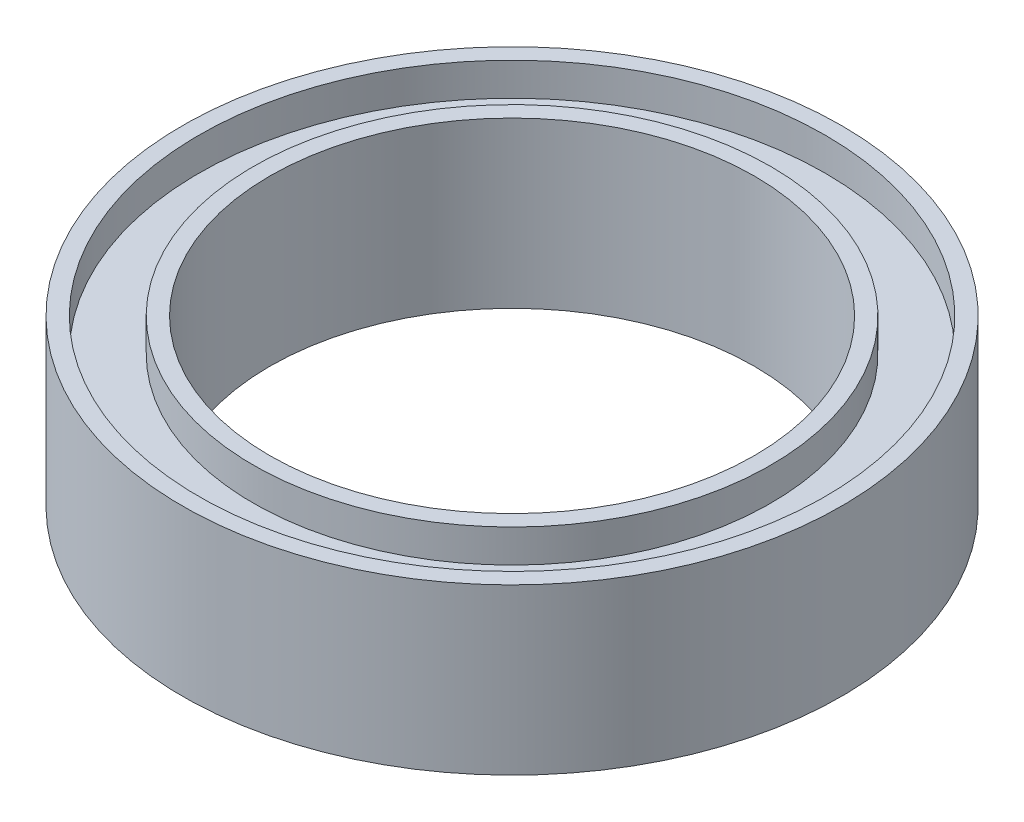
ISO-10303-21;
HEADER;
FILE_DESCRIPTION(('STEP AP214'),'2;1');
FILE_NAME('part.step','',(''),(''),'','','');
FILE_SCHEMA(('AUTOMOTIVE_DESIGN { 1 0 10303 214 1 1 1 1 }'));
ENDSEC;
DATA;
#1=APPLICATION_CONTEXT('core data for automotive mechanical design processes');
#2=APPLICATION_PROTOCOL_DEFINITION('international standard','automotive_design',2000,#1);
#3=PRODUCT_CONTEXT('',#1,'mechanical');
#4=PRODUCT('Part','Part','',(#3));
#5=PRODUCT_RELATED_PRODUCT_CATEGORY('part','',(#4));
#6=PRODUCT_DEFINITION_FORMATION('','',#4);
#7=PRODUCT_DEFINITION_CONTEXT('part definition',#1,'design');
#8=PRODUCT_DEFINITION('design','',#6,#7);
#9=PRODUCT_DEFINITION_SHAPE('','',#8);
#10=(LENGTH_UNIT() NAMED_UNIT(*) SI_UNIT(.MILLI.,.METRE.));
#11=(NAMED_UNIT(*) PLANE_ANGLE_UNIT() SI_UNIT($,.RADIAN.));
#12=(NAMED_UNIT(*) SI_UNIT($,.STERADIAN.) SOLID_ANGLE_UNIT());
#13=UNCERTAINTY_MEASURE_WITH_UNIT(LENGTH_MEASURE(1.E-05),#10,'distance_accuracy_value','');
#14=(GEOMETRIC_REPRESENTATION_CONTEXT(3) GLOBAL_UNCERTAINTY_ASSIGNED_CONTEXT((#13)) GLOBAL_UNIT_ASSIGNED_CONTEXT((#10,
#11,#12)) REPRESENTATION_CONTEXT('',''));
#15=CARTESIAN_POINT('',(0.,0.,0.));
#16=DIRECTION('',(0.,0.,1.));
#17=DIRECTION('',(1.,0.,0.));
#18=AXIS2_PLACEMENT_3D('',#15,#16,#17);
#19=CARTESIAN_POINT('',(0.,50.,0.));
#20=DIRECTION('',(0.,-1.,0.));
#21=DIRECTION('',(0.,0.,-1.));
#22=AXIS2_PLACEMENT_3D('',#19,#20,#21);
#23=PLANE('',#22);
#24=CARTESIAN_POINT('',(-73.5,50.,0.));
#25=DIRECTION('',(0.,-1.,0.));
#26=DIRECTION('',(0.,0.,-1.));
#27=AXIS2_PLACEMENT_3D('',#24,#25,#26);
#28=CIRCLE('',#27,100.);
#29=CARTESIAN_POINT('',(-73.5,50.,-100.));
#30=VERTEX_POINT('',#29);
#31=EDGE_CURVE('E79',#30,#30,#28,.T.);
#32=ORIENTED_EDGE('',*,*,#31,.F.);
#33=EDGE_LOOP('',(#32));
#34=FACE_BOUND('',#33,.T.);
#35=CARTESIAN_POINT('',(-73.5,50.,0.));
#36=DIRECTION('',(0.,-1.,0.));
#37=DIRECTION('',(0.,0.,-1.));
#38=AXIS2_PLACEMENT_3D('',#35,#36,#37);
#39=CIRCLE('',#38,95.);
#40=CARTESIAN_POINT('',(-73.5,50.,-95.));
#41=VERTEX_POINT('',#40);
#42=EDGE_CURVE('E10',#41,#41,#39,.T.);
#43=ORIENTED_EDGE('',*,*,#42,.T.);
#44=EDGE_LOOP('',(#43));
#45=FACE_BOUND('',#44,.T.);
#46=ADVANCED_FACE('F39',(#34,#45),#23,.F.);
#47=CARTESIAN_POINT('',(-73.5,0.,0.));
#48=DIRECTION('',(0.,-1.,0.));
#49=DIRECTION('',(0.,0.,-1.));
#50=AXIS2_PLACEMENT_3D('',#47,#48,#49);
#51=CYLINDRICAL_SURFACE('',#50,95.);
#52=ORIENTED_EDGE('',*,*,#42,.F.);
#53=EDGE_LOOP('',(#52));
#54=FACE_BOUND('',#53,.T.);
#55=CARTESIAN_POINT('',(-73.5,40.,0.));
#56=DIRECTION('',(0.,-1.,0.));
#57=DIRECTION('',(0.,0.,-1.));
#58=AXIS2_PLACEMENT_3D('',#55,#56,#57);
#59=CIRCLE('',#58,95.);
#60=CARTESIAN_POINT('',(-73.5,40.,-95.));
#61=VERTEX_POINT('',#60);
#62=EDGE_CURVE('E45',#61,#61,#59,.T.);
#63=ORIENTED_EDGE('',*,*,#62,.T.);
#64=EDGE_LOOP('',(#63));
#65=FACE_BOUND('',#64,.T.);
#66=ADVANCED_FACE('F86',(#54,#65),#51,.F.);
#67=CARTESIAN_POINT('',(0.,40.,0.));
#68=DIRECTION('',(0.,-1.,0.));
#69=DIRECTION('',(0.,0.,-1.));
#70=AXIS2_PLACEMENT_3D('',#67,#68,#69);
#71=PLANE('',#70);
#72=ORIENTED_EDGE('',*,*,#62,.F.);
#73=EDGE_LOOP('',(#72));
#74=FACE_BOUND('',#73,.T.);
#75=CARTESIAN_POINT('',(-73.5,40.,0.));
#76=DIRECTION('',(0.,-1.,0.));
#77=DIRECTION('',(0.,0.,-1.));
#78=AXIS2_PLACEMENT_3D('',#75,#76,#77);
#79=CIRCLE('',#78,78.5);
#80=CARTESIAN_POINT('',(-73.5,40.,-78.5));
#81=VERTEX_POINT('',#80);
#82=EDGE_CURVE('E49',#81,#81,#79,.T.);
#83=ORIENTED_EDGE('',*,*,#82,.T.);
#84=EDGE_LOOP('',(#83));
#85=FACE_BOUND('',#84,.T.);
#86=ADVANCED_FACE('F90',(#74,#85),#71,.F.);
#87=CARTESIAN_POINT('',(-73.5,0.,0.));
#88=DIRECTION('',(0.,-1.,0.));
#89=DIRECTION('',(0.,0.,-1.));
#90=AXIS2_PLACEMENT_3D('',#87,#88,#89);
#91=CYLINDRICAL_SURFACE('',#90,78.5);
#92=ORIENTED_EDGE('',*,*,#82,.F.);
#93=EDGE_LOOP('',(#92));
#94=FACE_BOUND('',#93,.T.);
#95=CARTESIAN_POINT('',(-73.5,50.,0.));
#96=DIRECTION('',(0.,-1.,0.));
#97=DIRECTION('',(0.,0.,-1.));
#98=AXIS2_PLACEMENT_3D('',#95,#96,#97);
#99=CIRCLE('',#98,78.5);
#100=CARTESIAN_POINT('',(-73.5,50.,-78.5));
#101=VERTEX_POINT('',#100);
#102=EDGE_CURVE('E53',#101,#101,#99,.T.);
#103=ORIENTED_EDGE('',*,*,#102,.T.);
#104=EDGE_LOOP('',(#103));
#105=FACE_BOUND('',#104,.T.);
#106=ADVANCED_FACE('F95',(#94,#105),#91,.T.);
#107=CARTESIAN_POINT('',(0.,50.,0.));
#108=DIRECTION('',(0.,-1.,0.));
#109=DIRECTION('',(0.,0.,-1.));
#110=AXIS2_PLACEMENT_3D('',#107,#108,#109);
#111=PLANE('',#110);
#112=ORIENTED_EDGE('',*,*,#102,.F.);
#113=EDGE_LOOP('',(#112));
#114=FACE_BOUND('',#113,.T.);
#115=CARTESIAN_POINT('',(-73.5,50.,0.));
#116=DIRECTION('',(0.,-1.,0.));
#117=DIRECTION('',(0.,0.,-1.));
#118=AXIS2_PLACEMENT_3D('',#115,#116,#117);
#119=CIRCLE('',#118,73.5);
#120=CARTESIAN_POINT('',(-73.5,50.,-73.5));
#121=VERTEX_POINT('',#120);
#122=EDGE_CURVE('E58',#121,#121,#119,.T.);
#123=ORIENTED_EDGE('',*,*,#122,.T.);
#124=EDGE_LOOP('',(#123));
#125=FACE_BOUND('',#124,.T.);
#126=ADVANCED_FACE('F101',(#114,#125),#111,.F.);
#127=CARTESIAN_POINT('',(-73.5,0.,0.));
#128=DIRECTION('',(0.,-1.,0.));
#129=DIRECTION('',(0.,0.,-1.));
#130=AXIS2_PLACEMENT_3D('',#127,#128,#129);
#131=CYLINDRICAL_SURFACE('',#130,73.5);
#132=ORIENTED_EDGE('',*,*,#122,.F.);
#133=EDGE_LOOP('',(#132));
#134=FACE_BOUND('',#133,.T.);
#135=CARTESIAN_POINT('',(-73.5,0.,0.));
#136=DIRECTION('',(0.,-1.,0.));
#137=DIRECTION('',(0.,0.,-1.));
#138=AXIS2_PLACEMENT_3D('',#135,#136,#137);
#139=CIRCLE('',#138,73.5);
#140=CARTESIAN_POINT('',(-73.5,0.,-73.5));
#141=VERTEX_POINT('',#140);
#142=EDGE_CURVE('E61',#141,#141,#139,.T.);
#143=ORIENTED_EDGE('',*,*,#142,.T.);
#144=EDGE_LOOP('',(#143));
#145=FACE_BOUND('',#144,.T.);
#146=ADVANCED_FACE('F105',(#134,#145),#131,.F.);
#147=CARTESIAN_POINT('',(0.,0.,0.));
#148=DIRECTION('',(0.,-1.,0.));
#149=DIRECTION('',(0.,0.,-1.));
#150=AXIS2_PLACEMENT_3D('',#147,#148,#149);
#151=PLANE('',#150);
#152=CARTESIAN_POINT('',(-73.5,0.,0.));
#153=DIRECTION('',(0.,-1.,0.));
#154=DIRECTION('',(0.,0.,-1.));
#155=AXIS2_PLACEMENT_3D('',#152,#153,#154);
#156=CIRCLE('',#155,78.5);
#157=CARTESIAN_POINT('',(-73.5,0.,-78.5));
#158=VERTEX_POINT('',#157);
#159=EDGE_CURVE('E64',#158,#158,#156,.T.);
#160=ORIENTED_EDGE('',*,*,#159,.T.);
#161=EDGE_LOOP('',(#160));
#162=FACE_BOUND('',#161,.T.);
#163=ORIENTED_EDGE('',*,*,#142,.F.);
#164=EDGE_LOOP('',(#163));
#165=FACE_BOUND('',#164,.T.);
#166=ADVANCED_FACE('F109',(#162,#165),#151,.T.);
#167=CARTESIAN_POINT('',(-73.5,0.,0.));
#168=DIRECTION('',(0.,-1.,0.));
#169=DIRECTION('',(0.,0.,-1.));
#170=AXIS2_PLACEMENT_3D('',#167,#168,#169);
#171=CYLINDRICAL_SURFACE('',#170,78.5);
#172=ORIENTED_EDGE('',*,*,#159,.F.);
#173=EDGE_LOOP('',(#172));
#174=FACE_BOUND('',#173,.T.);
#175=CARTESIAN_POINT('',(-73.5,32.,0.));
#176=DIRECTION('',(0.,-1.,0.));
#177=DIRECTION('',(0.,0.,-1.));
#178=AXIS2_PLACEMENT_3D('',#175,#176,#177);
#179=CIRCLE('',#178,78.5);
#180=CARTESIAN_POINT('',(-73.5,32.,-78.5));
#181=VERTEX_POINT('',#180);
#182=EDGE_CURVE('E67',#181,#181,#179,.T.);
#183=ORIENTED_EDGE('',*,*,#182,.T.);
#184=EDGE_LOOP('',(#183));
#185=FACE_BOUND('',#184,.T.);
#186=ADVANCED_FACE('F113',(#174,#185),#171,.T.);
#187=CARTESIAN_POINT('',(0.,32.,0.));
#188=DIRECTION('',(0.,-1.,0.));
#189=DIRECTION('',(0.,0.,-1.));
#190=AXIS2_PLACEMENT_3D('',#187,#188,#189);
#191=PLANE('',#190);
#192=CARTESIAN_POINT('',(-73.5,32.,0.));
#193=DIRECTION('',(0.,-1.,0.));
#194=DIRECTION('',(0.,0.,-1.));
#195=AXIS2_PLACEMENT_3D('',#192,#193,#194);
#196=CIRCLE('',#195,95.);
#197=CARTESIAN_POINT('',(-73.5,32.,-95.));
#198=VERTEX_POINT('',#197);
#199=EDGE_CURVE('E70',#198,#198,#196,.T.);
#200=ORIENTED_EDGE('',*,*,#199,.T.);
#201=EDGE_LOOP('',(#200));
#202=FACE_BOUND('',#201,.T.);
#203=ORIENTED_EDGE('',*,*,#182,.F.);
#204=EDGE_LOOP('',(#203));
#205=FACE_BOUND('',#204,.T.);
#206=ADVANCED_FACE('F117',(#202,#205),#191,.T.);
#207=CARTESIAN_POINT('',(-73.5,0.,0.));
#208=DIRECTION('',(0.,-1.,0.));
#209=DIRECTION('',(0.,0.,-1.));
#210=AXIS2_PLACEMENT_3D('',#207,#208,#209);
#211=CYLINDRICAL_SURFACE('',#210,95.);
#212=CARTESIAN_POINT('',(-73.5,0.,0.));
#213=DIRECTION('',(0.,-1.,0.));
#214=DIRECTION('',(0.,0.,-1.));
#215=AXIS2_PLACEMENT_3D('',#212,#213,#214);
#216=CIRCLE('',#215,95.);
#217=CARTESIAN_POINT('',(-73.5,0.,-95.));
#218=VERTEX_POINT('',#217);
#219=EDGE_CURVE('E73',#218,#218,#216,.T.);
#220=ORIENTED_EDGE('',*,*,#219,.T.);
#221=EDGE_LOOP('',(#220));
#222=FACE_BOUND('',#221,.T.);
#223=ORIENTED_EDGE('',*,*,#199,.F.);
#224=EDGE_LOOP('',(#223));
#225=FACE_BOUND('',#224,.T.);
#226=ADVANCED_FACE('F121',(#222,#225),#211,.F.);
#227=CARTESIAN_POINT('',(0.,0.,0.));
#228=DIRECTION('',(0.,-1.,0.));
#229=DIRECTION('',(0.,0.,-1.));
#230=AXIS2_PLACEMENT_3D('',#227,#228,#229);
#231=PLANE('',#230);
#232=CARTESIAN_POINT('',(-73.5,0.,0.));
#233=DIRECTION('',(0.,-1.,0.));
#234=DIRECTION('',(0.,0.,-1.));
#235=AXIS2_PLACEMENT_3D('',#232,#233,#234);
#236=CIRCLE('',#235,100.);
#237=CARTESIAN_POINT('',(-73.5,0.,-100.));
#238=VERTEX_POINT('',#237);
#239=EDGE_CURVE('E76',#238,#238,#236,.T.);
#240=ORIENTED_EDGE('',*,*,#239,.T.);
#241=EDGE_LOOP('',(#240));
#242=FACE_BOUND('',#241,.T.);
#243=ORIENTED_EDGE('',*,*,#219,.F.);
#244=EDGE_LOOP('',(#243));
#245=FACE_BOUND('',#244,.T.);
#246=ADVANCED_FACE('F125',(#242,#245),#231,.T.);
#247=CARTESIAN_POINT('',(-73.5,0.,0.));
#248=DIRECTION('',(0.,-1.,0.));
#249=DIRECTION('',(0.,0.,-1.));
#250=AXIS2_PLACEMENT_3D('',#247,#248,#249);
#251=CYLINDRICAL_SURFACE('',#250,100.);
#252=ORIENTED_EDGE('',*,*,#239,.F.);
#253=EDGE_LOOP('',(#252));
#254=FACE_BOUND('',#253,.T.);
#255=ORIENTED_EDGE('',*,*,#31,.T.);
#256=EDGE_LOOP('',(#255));
#257=FACE_BOUND('',#256,.T.);
#258=ADVANCED_FACE('F83',(#254,#257),#251,.T.);
#259=CLOSED_SHELL('',(#46,#66,#86,#106,#126,#146,#166,#186,#206,#226,#246,#258));
#260=MANIFOLD_SOLID_BREP('B2',#259);
#261=ADVANCED_BREP_SHAPE_REPRESENTATION('',(#18,#260),#14);
#262=SHAPE_DEFINITION_REPRESENTATION(#9,#261);
ENDSEC;
END-ISO-10303-21;
